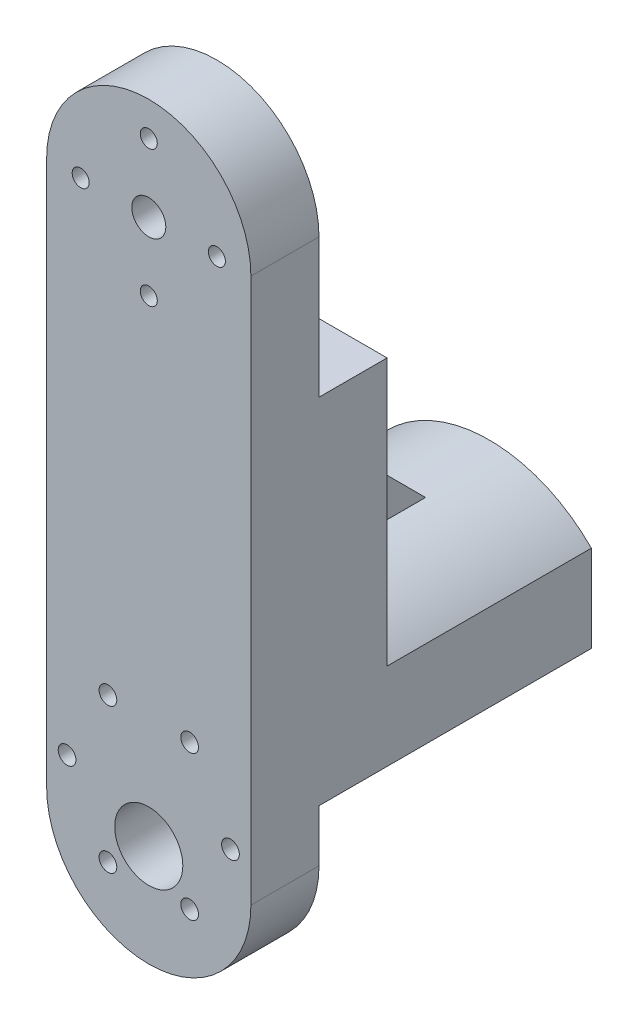
ISO-10303-21;
HEADER;
FILE_DESCRIPTION(('STEP AP214'),'2;1');
FILE_NAME('part.step','',(''),(''),'','','');
FILE_SCHEMA(('AUTOMOTIVE_DESIGN { 1 0 10303 214 1 1 1 1 }'));
ENDSEC;
DATA;
#1=APPLICATION_CONTEXT('core data for automotive mechanical design processes');
#2=APPLICATION_PROTOCOL_DEFINITION('international standard','automotive_design',2000,#1);
#3=PRODUCT_CONTEXT('',#1,'mechanical');
#4=PRODUCT('Part','Part','',(#3));
#5=PRODUCT_RELATED_PRODUCT_CATEGORY('part','',(#4));
#6=PRODUCT_DEFINITION_FORMATION('','',#4);
#7=PRODUCT_DEFINITION_CONTEXT('part definition',#1,'design');
#8=PRODUCT_DEFINITION('design','',#6,#7);
#9=PRODUCT_DEFINITION_SHAPE('','',#8);
#10=(LENGTH_UNIT() NAMED_UNIT(*) SI_UNIT(.MILLI.,.METRE.));
#11=(NAMED_UNIT(*) PLANE_ANGLE_UNIT() SI_UNIT($,.RADIAN.));
#12=(NAMED_UNIT(*) SI_UNIT($,.STERADIAN.) SOLID_ANGLE_UNIT());
#13=UNCERTAINTY_MEASURE_WITH_UNIT(LENGTH_MEASURE(1.E-05),#10,'distance_accuracy_value','');
#14=(GEOMETRIC_REPRESENTATION_CONTEXT(3) GLOBAL_UNCERTAINTY_ASSIGNED_CONTEXT((#13)) GLOBAL_UNIT_ASSIGNED_CONTEXT((#10,
#11,#12)) REPRESENTATION_CONTEXT('',''));
#15=CARTESIAN_POINT('',(0.,0.,0.));
#16=DIRECTION('',(0.,0.,1.));
#17=DIRECTION('',(1.,0.,0.));
#18=AXIS2_PLACEMENT_3D('',#15,#16,#17);
#19=CARTESIAN_POINT('',(-19.051,-24.892,12.7));
#20=DIRECTION('',(0.,0.,1.));
#21=DIRECTION('',(0.,-1.,0.));
#22=AXIS2_PLACEMENT_3D('',#19,#20,#21);
#23=PLANE('',#22);
#24=CARTESIAN_POINT('',(0.,-50.8,12.7));
#25=DIRECTION('',(0.,0.,1.));
#26=DIRECTION('',(0.,-1.,0.));
#27=AXIS2_PLACEMENT_3D('',#24,#25,#26);
#28=CIRCLE('',#27,6.35);
#29=CARTESIAN_POINT('',(0.,-57.15,12.7));
#30=VERTEX_POINT('',#29);
#31=EDGE_CURVE('E221',#30,#30,#28,.F.);
#32=ORIENTED_EDGE('',*,*,#31,.F.);
#33=EDGE_LOOP('',(#32));
#34=FACE_BOUND('',#33,.T.);
#35=CARTESIAN_POINT('',(7.62000000000001,-30.1972759275123,12.7));
#36=DIRECTION('',(0.,0.,1.));
#37=DIRECTION('',(0.,-1.,0.));
#38=AXIS2_PLACEMENT_3D('',#35,#36,#37);
#39=CIRCLE('',#38,1.651);
#40=CARTESIAN_POINT('',(7.62000000000001,-31.8482759275123,12.7));
#41=VERTEX_POINT('',#40);
#42=EDGE_CURVE('E273',#41,#41,#39,.F.);
#43=ORIENTED_EDGE('',*,*,#42,.F.);
#44=EDGE_LOOP('',(#43));
#45=FACE_BOUND('',#44,.T.);
#46=CARTESIAN_POINT('',(7.61999999999998,-57.1787240724877,12.7));
#47=DIRECTION('',(0.,0.,1.));
#48=DIRECTION('',(0.,-1.,0.));
#49=AXIS2_PLACEMENT_3D('',#46,#47,#48);
#50=CIRCLE('',#49,1.651);
#51=CARTESIAN_POINT('',(7.61999999999998,-58.8297240724877,12.7));
#52=VERTEX_POINT('',#51);
#53=EDGE_CURVE('E267',#52,#52,#50,.F.);
#54=ORIENTED_EDGE('',*,*,#53,.F.);
#55=EDGE_LOOP('',(#54));
#56=FACE_BOUND('',#55,.T.);
#57=CARTESIAN_POINT('',(-7.62000000000002,-57.1787240724877,12.7));
#58=DIRECTION('',(0.,0.,1.));
#59=DIRECTION('',(0.,-1.,0.));
#60=AXIS2_PLACEMENT_3D('',#57,#58,#59);
#61=CIRCLE('',#60,1.651);
#62=CARTESIAN_POINT('',(-7.62000000000002,-58.8297240724877,12.7));
#63=VERTEX_POINT('',#62);
#64=EDGE_CURVE('E259',#63,#63,#61,.F.);
#65=ORIENTED_EDGE('',*,*,#64,.F.);
#66=EDGE_LOOP('',(#65));
#67=FACE_BOUND('',#66,.T.);
#68=CARTESIAN_POINT('',(-15.24,-43.688,12.7));
#69=DIRECTION('',(0.,0.,1.));
#70=DIRECTION('',(0.,-1.,0.));
#71=AXIS2_PLACEMENT_3D('',#68,#69,#70);
#72=CIRCLE('',#71,1.651);
#73=CARTESIAN_POINT('',(-15.24,-45.339,12.7));
#74=VERTEX_POINT('',#73);
#75=EDGE_CURVE('E260',#74,#74,#72,.F.);
#76=ORIENTED_EDGE('',*,*,#75,.F.);
#77=EDGE_LOOP('',(#76));
#78=FACE_BOUND('',#77,.T.);
#79=CARTESIAN_POINT('',(-7.62000000000002,-30.1972759275123,12.7));
#80=DIRECTION('',(0.,0.,1.));
#81=DIRECTION('',(0.,-1.,0.));
#82=AXIS2_PLACEMENT_3D('',#79,#80,#81);
#83=CIRCLE('',#82,1.651);
#84=CARTESIAN_POINT('',(-7.62000000000002,-31.8482759275123,12.7));
#85=VERTEX_POINT('',#84);
#86=EDGE_CURVE('E284',#85,#85,#83,.F.);
#87=ORIENTED_EDGE('',*,*,#86,.F.);
#88=EDGE_LOOP('',(#87));
#89=FACE_BOUND('',#88,.T.);
#90=CARTESIAN_POINT('',(15.24,-43.688,12.7));
#91=DIRECTION('',(0.,0.,1.));
#92=DIRECTION('',(0.,-1.,0.));
#93=AXIS2_PLACEMENT_3D('',#90,#91,#92);
#94=CIRCLE('',#93,1.65099999999999);
#95=CARTESIAN_POINT('',(15.24,-45.339,12.7));
#96=VERTEX_POINT('',#95);
#97=EDGE_CURVE('E279',#96,#96,#94,.F.);
#98=ORIENTED_EDGE('',*,*,#97,.F.);
#99=EDGE_LOOP('',(#98));
#100=FACE_BOUND('',#99,.T.);
#101=DIRECTION('',(1.,0.,0.));
#102=VECTOR('',#101,1.);
#103=CARTESIAN_POINT('',(-19.05,-41.148,12.7));
#104=LINE('',#103,#102);
#105=CARTESIAN_POINT('',(-19.05,-41.148,12.7));
#106=VERTEX_POINT('',#105);
#107=CARTESIAN_POINT('',(-18.3248028638783,-41.148,12.7));
#108=VERTEX_POINT('',#107);
#109=EDGE_CURVE('E323',#106,#108,#104,.T.);
#110=ORIENTED_EDGE('',*,*,#109,.T.);
#111=CARTESIAN_POINT('',(0.,-43.688,12.7));
#112=DIRECTION('',(0.,0.,1.));
#113=DIRECTION('',(0.,-1.,0.));
#114=AXIS2_PLACEMENT_3D('',#111,#112,#113);
#115=CIRCLE('',#114,18.5);
#116=CARTESIAN_POINT('',(18.3248028638782,-41.148,12.7));
#117=VERTEX_POINT('',#116);
#118=EDGE_CURVE('E329',#108,#117,#115,.F.);
#119=ORIENTED_EDGE('',*,*,#118,.T.);
#120=DIRECTION('',(0.997629661882093,0.0688117557763239,0.));
#121=VECTOR('',#120,1.);
#122=CARTESIAN_POINT('',(18.3248028638783,-41.148,12.7));
#123=LINE('',#122,#121);
#124=CARTESIAN_POINT('',(19.05,-41.0979793459164,12.7));
#125=VERTEX_POINT('',#124);
#126=EDGE_CURVE('E332',#117,#125,#123,.T.);
#127=ORIENTED_EDGE('',*,*,#126,.T.);
#128=DIRECTION('',(0.,-1.,0.));
#129=VECTOR('',#128,1.);
#130=CARTESIAN_POINT('',(19.05,-24.892,12.7));
#131=LINE('',#130,#129);
#132=CARTESIAN_POINT('',(19.05,-50.8,12.7));
#133=VERTEX_POINT('',#132);
#134=EDGE_CURVE('E215',#125,#133,#131,.T.);
#135=ORIENTED_EDGE('',*,*,#134,.T.);
#136=CARTESIAN_POINT('',(0.,-50.8,12.7));
#137=DIRECTION('',(0.,0.,1.));
#138=DIRECTION('',(0.,-1.,0.));
#139=AXIS2_PLACEMENT_3D('',#136,#137,#138);
#140=CIRCLE('',#139,19.05);
#141=CARTESIAN_POINT('',(-19.05,-50.8,12.7));
#142=VERTEX_POINT('',#141);
#143=EDGE_CURVE('E224',#133,#142,#140,.F.);
#144=ORIENTED_EDGE('',*,*,#143,.T.);
#145=DIRECTION('',(0.,1.,0.));
#146=VECTOR('',#145,1.);
#147=CARTESIAN_POINT('',(-19.05,-24.892,12.7));
#148=LINE('',#147,#146);
#149=EDGE_CURVE('E218',#142,#106,#148,.T.);
#150=ORIENTED_EDGE('',*,*,#149,.T.);
#151=EDGE_LOOP('',(#110,#119,#127,#135,#144,#150));
#152=FACE_BOUND('',#151,.T.);
#153=ADVANCED_FACE('F34',(#34,#45,#56,#67,#78,#89,#100,#152),#23,.F.);
#154=CARTESIAN_POINT('',(0.,50.8,25.4));
#155=DIRECTION('',(0.,0.,-1.));
#156=DIRECTION('',(-1.,0.,0.));
#157=AXIS2_PLACEMENT_3D('',#154,#155,#156);
#158=PLANE('',#157);
#159=CARTESIAN_POINT('',(15.24,-43.688,25.4));
#160=DIRECTION('',(0.,0.,-1.));
#161=DIRECTION('',(-1.,0.,0.));
#162=AXIS2_PLACEMENT_3D('',#159,#160,#161);
#163=CIRCLE('',#162,1.65099999999999);
#164=CARTESIAN_POINT('',(13.589,-43.688,25.4));
#165=VERTEX_POINT('',#164);
#166=EDGE_CURVE('E226',#165,#165,#163,.F.);
#167=ORIENTED_EDGE('',*,*,#166,.F.);
#168=EDGE_LOOP('',(#167));
#169=FACE_BOUND('',#168,.T.);
#170=CARTESIAN_POINT('',(-7.62000000000002,-30.1972759275123,25.4));
#171=DIRECTION('',(0.,0.,-1.));
#172=DIRECTION('',(-1.,0.,0.));
#173=AXIS2_PLACEMENT_3D('',#170,#171,#172);
#174=CIRCLE('',#173,1.651);
#175=CARTESIAN_POINT('',(-9.27100000000002,-30.1972759275123,25.4));
#176=VERTEX_POINT('',#175);
#177=EDGE_CURVE('E263',#176,#176,#174,.F.);
#178=ORIENTED_EDGE('',*,*,#177,.F.);
#179=EDGE_LOOP('',(#178));
#180=FACE_BOUND('',#179,.T.);
#181=CARTESIAN_POINT('',(-15.24,-43.688,25.4));
#182=DIRECTION('',(0.,0.,-1.));
#183=DIRECTION('',(-1.,0.,0.));
#184=AXIS2_PLACEMENT_3D('',#181,#182,#183);
#185=CIRCLE('',#184,1.651);
#186=CARTESIAN_POINT('',(-16.891,-43.688,25.4));
#187=VERTEX_POINT('',#186);
#188=EDGE_CURVE('E256',#187,#187,#185,.F.);
#189=ORIENTED_EDGE('',*,*,#188,.F.);
#190=EDGE_LOOP('',(#189));
#191=FACE_BOUND('',#190,.T.);
#192=CARTESIAN_POINT('',(-7.62000000000002,-57.1787240724877,25.4));
#193=DIRECTION('',(0.,0.,-1.));
#194=DIRECTION('',(-1.,0.,0.));
#195=AXIS2_PLACEMENT_3D('',#192,#193,#194);
#196=CIRCLE('',#195,1.651);
#197=CARTESIAN_POINT('',(-9.27100000000001,-57.1787240724877,25.4));
#198=VERTEX_POINT('',#197);
#199=EDGE_CURVE('E264',#198,#198,#196,.F.);
#200=ORIENTED_EDGE('',*,*,#199,.F.);
#201=EDGE_LOOP('',(#200));
#202=FACE_BOUND('',#201,.T.);
#203=CARTESIAN_POINT('',(7.61999999999998,-57.1787240724877,25.4));
#204=DIRECTION('',(0.,0.,-1.));
#205=DIRECTION('',(-1.,0.,0.));
#206=AXIS2_PLACEMENT_3D('',#203,#204,#205);
#207=CIRCLE('',#206,1.651);
#208=CARTESIAN_POINT('',(5.96899999999999,-57.1787240724877,25.4));
#209=VERTEX_POINT('',#208);
#210=EDGE_CURVE('E270',#209,#209,#207,.F.);
#211=ORIENTED_EDGE('',*,*,#210,.F.);
#212=EDGE_LOOP('',(#211));
#213=FACE_BOUND('',#212,.T.);
#214=CARTESIAN_POINT('',(7.62000000000001,-30.1972759275123,25.4));
#215=DIRECTION('',(0.,0.,-1.));
#216=DIRECTION('',(-1.,0.,0.));
#217=AXIS2_PLACEMENT_3D('',#214,#215,#216);
#218=CIRCLE('',#217,1.651);
#219=CARTESIAN_POINT('',(5.96900000000001,-30.1972759275123,25.4));
#220=VERTEX_POINT('',#219);
#221=EDGE_CURVE('E276',#220,#220,#218,.F.);
#222=ORIENTED_EDGE('',*,*,#221,.F.);
#223=EDGE_LOOP('',(#222));
#224=FACE_BOUND('',#223,.T.);
#225=CARTESIAN_POINT('',(0.,50.8,25.4));
#226=DIRECTION('',(0.,0.,1.));
#227=DIRECTION('',(-1.,0.,0.));
#228=AXIS2_PLACEMENT_3D('',#225,#226,#227);
#229=CIRCLE('',#228,19.05);
#230=CARTESIAN_POINT('',(19.05,50.8,25.4));
#231=VERTEX_POINT('',#230);
#232=CARTESIAN_POINT('',(-19.05,50.8,25.4));
#233=VERTEX_POINT('',#232);
#234=EDGE_CURVE('E186',#231,#233,#229,.T.);
#235=ORIENTED_EDGE('',*,*,#234,.T.);
#236=DIRECTION('',(0.,-1.,0.));
#237=VECTOR('',#236,1.);
#238=CARTESIAN_POINT('',(-19.05,50.8,25.4));
#239=LINE('',#238,#237);
#240=CARTESIAN_POINT('',(-19.05,-50.8,25.4));
#241=VERTEX_POINT('',#240);
#242=EDGE_CURVE('E193',#233,#241,#239,.T.);
#243=ORIENTED_EDGE('',*,*,#242,.T.);
#244=CARTESIAN_POINT('',(0.,-50.8,25.4));
#245=DIRECTION('',(0.,0.,1.));
#246=DIRECTION('',(1.,0.,0.));
#247=AXIS2_PLACEMENT_3D('',#244,#245,#246);
#248=CIRCLE('',#247,19.05);
#249=CARTESIAN_POINT('',(19.05,-50.8,25.4));
#250=VERTEX_POINT('',#249);
#251=EDGE_CURVE('E191',#241,#250,#248,.T.);
#252=ORIENTED_EDGE('',*,*,#251,.T.);
#253=DIRECTION('',(0.,1.,0.));
#254=VECTOR('',#253,1.);
#255=CARTESIAN_POINT('',(19.05,50.8,25.4));
#256=LINE('',#255,#254);
#257=EDGE_CURVE('E182',#250,#231,#256,.T.);
#258=ORIENTED_EDGE('',*,*,#257,.T.);
#259=EDGE_LOOP('',(#235,#243,#252,#258));
#260=FACE_BOUND('',#259,.T.);
#261=CARTESIAN_POINT('',(0.,50.8,25.4));
#262=DIRECTION('',(0.,0.,1.));
#263=DIRECTION('',(1.,0.,0.));
#264=AXIS2_PLACEMENT_3D('',#261,#262,#263);
#265=CIRCLE('',#264,3.175);
#266=CARTESIAN_POINT('',(3.17499999999998,50.8,25.4));
#267=VERTEX_POINT('',#266);
#268=EDGE_CURVE('E189',#267,#267,#265,.T.);
#269=ORIENTED_EDGE('',*,*,#268,.F.);
#270=EDGE_LOOP('',(#269));
#271=FACE_BOUND('',#270,.T.);
#272=CARTESIAN_POINT('',(0.,-50.8,25.4));
#273=DIRECTION('',(0.,0.,1.));
#274=DIRECTION('',(1.,0.,0.));
#275=AXIS2_PLACEMENT_3D('',#272,#273,#274);
#276=CIRCLE('',#275,6.35);
#277=CARTESIAN_POINT('',(6.35000000000001,-50.8,25.4));
#278=VERTEX_POINT('',#277);
#279=EDGE_CURVE('E199',#278,#278,#276,.T.);
#280=ORIENTED_EDGE('',*,*,#279,.F.);
#281=EDGE_LOOP('',(#280));
#282=FACE_BOUND('',#281,.T.);
#283=CARTESIAN_POINT('',(0.,63.5,25.4));
#284=DIRECTION('',(0.,0.,1.));
#285=DIRECTION('',(1.,0.,0.));
#286=AXIS2_PLACEMENT_3D('',#283,#284,#285);
#287=CIRCLE('',#286,1.5875);
#288=CARTESIAN_POINT('',(1.5875,63.5,25.4));
#289=VERTEX_POINT('',#288);
#290=EDGE_CURVE('E202',#289,#289,#287,.T.);
#291=ORIENTED_EDGE('',*,*,#290,.F.);
#292=EDGE_LOOP('',(#291));
#293=FACE_BOUND('',#292,.T.);
#294=CARTESIAN_POINT('',(-12.7,50.8,25.4));
#295=DIRECTION('',(0.,0.,1.));
#296=DIRECTION('',(1.,0.,0.));
#297=AXIS2_PLACEMENT_3D('',#294,#295,#296);
#298=CIRCLE('',#297,1.5875);
#299=CARTESIAN_POINT('',(-11.1125,50.8,25.4));
#300=VERTEX_POINT('',#299);
#301=EDGE_CURVE('E205',#300,#300,#298,.T.);
#302=ORIENTED_EDGE('',*,*,#301,.F.);
#303=EDGE_LOOP('',(#302));
#304=FACE_BOUND('',#303,.T.);
#305=CARTESIAN_POINT('',(0.,38.1,25.4));
#306=DIRECTION('',(0.,0.,1.));
#307=DIRECTION('',(1.,0.,0.));
#308=AXIS2_PLACEMENT_3D('',#305,#306,#307);
#309=CIRCLE('',#308,1.5875);
#310=CARTESIAN_POINT('',(1.5875,38.1,25.4));
#311=VERTEX_POINT('',#310);
#312=EDGE_CURVE('E208',#311,#311,#309,.T.);
#313=ORIENTED_EDGE('',*,*,#312,.F.);
#314=EDGE_LOOP('',(#313));
#315=FACE_BOUND('',#314,.T.);
#316=CARTESIAN_POINT('',(12.7,50.8,25.4));
#317=DIRECTION('',(0.,0.,1.));
#318=DIRECTION('',(1.,0.,0.));
#319=AXIS2_PLACEMENT_3D('',#316,#317,#318);
#320=CIRCLE('',#319,1.5875);
#321=CARTESIAN_POINT('',(14.2875,50.8,25.4));
#322=VERTEX_POINT('',#321);
#323=EDGE_CURVE('E211',#322,#322,#320,.T.);
#324=ORIENTED_EDGE('',*,*,#323,.F.);
#325=EDGE_LOOP('',(#324));
#326=FACE_BOUND('',#325,.T.);
#327=ADVANCED_FACE('F374',(#169,#180,#191,#202,#213,#224,#260,#271,#282,#293,#304,#315,#326),
#158,.F.);
#328=CARTESIAN_POINT('',(0.,50.8,0.));
#329=DIRECTION('',(0.,0.,-1.));
#330=DIRECTION('',(-1.,0.,0.));
#331=AXIS2_PLACEMENT_3D('',#328,#329,#330);
#332=PLANE('',#331);
#333=DIRECTION('',(0.,-1.,0.));
#334=VECTOR('',#333,1.);
#335=CARTESIAN_POINT('',(3.175,-19.4662340642476,0.));
#336=LINE('',#335,#334);
#337=CARTESIAN_POINT('',(3.175,5.93376593575245,0.));
#338=VERTEX_POINT('',#337);
#339=CARTESIAN_POINT('',(3.175,-17.1152415620809,0.));
#340=VERTEX_POINT('',#339);
#341=EDGE_CURVE('E49',#338,#340,#336,.T.);
#342=ORIENTED_EDGE('',*,*,#341,.F.);
#343=DIRECTION('',(-1.,0.,0.));
#344=VECTOR('',#343,1.);
#345=CARTESIAN_POINT('',(3.175,5.93376593575244,0.));
#346=LINE('',#345,#344);
#347=CARTESIAN_POINT('',(-3.175,5.93376593575244,0.));
#348=VERTEX_POINT('',#347);
#349=EDGE_CURVE('E54',#338,#348,#346,.T.);
#350=ORIENTED_EDGE('',*,*,#349,.T.);
#351=DIRECTION('',(0.,-1.,0.));
#352=VECTOR('',#351,1.);
#353=CARTESIAN_POINT('',(-3.175,-19.4662340642476,0.));
#354=LINE('',#353,#352);
#355=CARTESIAN_POINT('',(-3.175,-17.1152415620809,0.));
#356=VERTEX_POINT('',#355);
#357=EDGE_CURVE('E160',#348,#356,#354,.T.);
#358=ORIENTED_EDGE('',*,*,#357,.T.);
#359=CARTESIAN_POINT('',(0.,-43.688,0.));
#360=DIRECTION('',(0.,0.,-1.));
#361=DIRECTION('',(1.,0.,0.));
#362=AXIS2_PLACEMENT_3D('',#359,#360,#361);
#363=CIRCLE('',#362,26.7617659357524);
#364=CARTESIAN_POINT('',(-19.05,-24.892,0.));
#365=VERTEX_POINT('',#364);
#366=EDGE_CURVE('E146',#365,#356,#363,.T.);
#367=ORIENTED_EDGE('',*,*,#366,.F.);
#368=DIRECTION('',(0.,-1.,0.));
#369=VECTOR('',#368,1.);
#370=CARTESIAN_POINT('',(-19.05,50.8,0.));
#371=LINE('',#370,#369);
#372=CARTESIAN_POINT('',(-19.05,24.892,0.));
#373=VERTEX_POINT('',#372);
#374=EDGE_CURVE('E187',#373,#365,#371,.T.);
#375=ORIENTED_EDGE('',*,*,#374,.F.);
#376=DIRECTION('',(1.,0.,0.));
#377=VECTOR('',#376,1.);
#378=CARTESIAN_POINT('',(-19.051,24.892,0.));
#379=LINE('',#378,#377);
#380=CARTESIAN_POINT('',(19.05,24.892,0.));
#381=VERTEX_POINT('',#380);
#382=EDGE_CURVE('E228',#373,#381,#379,.T.);
#383=ORIENTED_EDGE('',*,*,#382,.T.);
#384=DIRECTION('',(0.,1.,0.));
#385=VECTOR('',#384,1.);
#386=CARTESIAN_POINT('',(19.05,50.8,0.));
#387=LINE('',#386,#385);
#388=CARTESIAN_POINT('',(19.05,-24.892,0.));
#389=VERTEX_POINT('',#388);
#390=EDGE_CURVE('E183',#389,#381,#387,.T.);
#391=ORIENTED_EDGE('',*,*,#390,.F.);
#392=EDGE_CURVE('E157',#340,#389,#363,.T.);
#393=ORIENTED_EDGE('',*,*,#392,.F.);
#394=EDGE_LOOP('',(#342,#350,#358,#367,#375,#383,#391,#393));
#395=FACE_BOUND('',#394,.T.);
#396=ADVANCED_FACE('F161',(#395),#332,.T.);
#397=CARTESIAN_POINT('',(0.,50.8,25.4));
#398=DIRECTION('',(0.,0.,-1.));
#399=DIRECTION('',(-1.,0.,0.));
#400=AXIS2_PLACEMENT_3D('',#397,#398,#399);
#401=CYLINDRICAL_SURFACE('',#400,19.05);
#402=DIRECTION('',(0.,0.,-1.));
#403=VECTOR('',#402,1.);
#404=CARTESIAN_POINT('',(19.05,50.8,25.4));
#405=LINE('',#404,#403);
#406=CARTESIAN_POINT('',(19.05,50.8,12.7));
#407=VERTEX_POINT('',#406);
#408=EDGE_CURVE('E179',#231,#407,#405,.T.);
#409=ORIENTED_EDGE('',*,*,#408,.T.);
#410=CARTESIAN_POINT('',(0.,50.8,12.7));
#411=DIRECTION('',(0.,0.,1.));
#412=DIRECTION('',(0.,-1.,0.));
#413=AXIS2_PLACEMENT_3D('',#410,#411,#412);
#414=CIRCLE('',#413,19.05);
#415=CARTESIAN_POINT('',(-19.05,50.8,12.7));
#416=VERTEX_POINT('',#415);
#417=EDGE_CURVE('E217',#416,#407,#414,.F.);
#418=ORIENTED_EDGE('',*,*,#417,.F.);
#419=DIRECTION('',(0.,0.,-1.));
#420=VECTOR('',#419,1.);
#421=CARTESIAN_POINT('',(-19.05,50.8,25.4));
#422=LINE('',#421,#420);
#423=EDGE_CURVE('E168',#233,#416,#422,.T.);
#424=ORIENTED_EDGE('',*,*,#423,.F.);
#425=ORIENTED_EDGE('',*,*,#234,.F.);
#426=EDGE_LOOP('',(#409,#418,#424,#425));
#427=FACE_BOUND('',#426,.T.);
#428=ADVANCED_FACE('F36',(#427),#401,.T.);
#429=CARTESIAN_POINT('',(-19.05,50.8,25.4));
#430=DIRECTION('',(1.,0.,0.));
#431=DIRECTION('',(0.,0.,-1.));
#432=AXIS2_PLACEMENT_3D('',#429,#430,#431);
#433=PLANE('',#432);
#434=DIRECTION('',(0.,0.,1.));
#435=VECTOR('',#434,1.);
#436=CARTESIAN_POINT('',(-19.05,-41.148,-38.1));
#437=LINE('',#436,#435);
#438=CARTESIAN_POINT('',(-19.05,-41.148,-38.1));
#439=VERTEX_POINT('',#438);
#440=EDGE_CURVE('E293',#439,#106,#437,.T.);
#441=ORIENTED_EDGE('',*,*,#440,.T.);
#442=ORIENTED_EDGE('',*,*,#149,.F.);
#443=DIRECTION('',(0.,0.,-1.));
#444=VECTOR('',#443,1.);
#445=CARTESIAN_POINT('',(-19.05,-50.8,25.4));
#446=LINE('',#445,#444);
#447=EDGE_CURVE('E171',#241,#142,#446,.T.);
#448=ORIENTED_EDGE('',*,*,#447,.F.);
#449=ORIENTED_EDGE('',*,*,#242,.F.);
#450=ORIENTED_EDGE('',*,*,#423,.T.);
#451=DIRECTION('',(0.,1.,0.));
#452=VECTOR('',#451,1.);
#453=CARTESIAN_POINT('',(-19.05,69.85,12.7));
#454=LINE('',#453,#452);
#455=CARTESIAN_POINT('',(-19.05,24.892,12.7));
#456=VERTEX_POINT('',#455);
#457=EDGE_CURVE('E214',#456,#416,#454,.T.);
#458=ORIENTED_EDGE('',*,*,#457,.F.);
#459=DIRECTION('',(0.,0.,1.));
#460=VECTOR('',#459,1.);
#461=CARTESIAN_POINT('',(-19.05,24.892,0.));
#462=LINE('',#461,#460);
#463=EDGE_CURVE('E232',#373,#456,#462,.T.);
#464=ORIENTED_EDGE('',*,*,#463,.F.);
#465=ORIENTED_EDGE('',*,*,#374,.T.);
#466=DIRECTION('',(0.,0.,1.));
#467=VECTOR('',#466,1.);
#468=CARTESIAN_POINT('',(-19.05,-24.892,-38.1));
#469=LINE('',#468,#467);
#470=CARTESIAN_POINT('',(-19.05,-24.892,-38.1));
#471=VERTEX_POINT('',#470);
#472=EDGE_CURVE('E153',#471,#365,#469,.T.);
#473=ORIENTED_EDGE('',*,*,#472,.F.);
#474=DIRECTION('',(0.,1.,0.));
#475=VECTOR('',#474,1.);
#476=CARTESIAN_POINT('',(-19.05,-24.892,-38.1));
#477=LINE('',#476,#475);
#478=EDGE_CURVE('E314',#439,#471,#477,.T.);
#479=ORIENTED_EDGE('',*,*,#478,.F.);
#480=EDGE_LOOP('',(#441,#442,#448,#449,#450,#458,#464,#465,#473,#479));
#481=FACE_BOUND('',#480,.T.);
#482=ADVANCED_FACE('F358',(#481),#433,.F.);
#483=CARTESIAN_POINT('',(0.,-50.8,25.4));
#484=DIRECTION('',(0.,0.,-1.));
#485=DIRECTION('',(-1.,0.,0.));
#486=AXIS2_PLACEMENT_3D('',#483,#484,#485);
#487=CYLINDRICAL_SURFACE('',#486,19.05);
#488=ORIENTED_EDGE('',*,*,#447,.T.);
#489=ORIENTED_EDGE('',*,*,#143,.F.);
#490=DIRECTION('',(0.,0.,-1.));
#491=VECTOR('',#490,1.);
#492=CARTESIAN_POINT('',(19.05,-50.8,25.4));
#493=LINE('',#492,#491);
#494=EDGE_CURVE('E176',#250,#133,#493,.T.);
#495=ORIENTED_EDGE('',*,*,#494,.F.);
#496=ORIENTED_EDGE('',*,*,#251,.F.);
#497=EDGE_LOOP('',(#488,#489,#495,#496));
#498=FACE_BOUND('',#497,.T.);
#499=ADVANCED_FACE('F381',(#498),#487,.T.);
#500=CARTESIAN_POINT('',(19.05,50.8,25.4));
#501=DIRECTION('',(-1.,0.,0.));
#502=DIRECTION('',(0.,0.,1.));
#503=AXIS2_PLACEMENT_3D('',#500,#501,#502);
#504=PLANE('',#503);
#505=ORIENTED_EDGE('',*,*,#134,.F.);
#506=DIRECTION('',(0.,0.,-1.));
#507=VECTOR('',#506,1.);
#508=CARTESIAN_POINT('',(19.05,-41.0979793459164,54.123031468013));
#509=LINE('',#508,#507);
#510=CARTESIAN_POINT('',(19.05,-41.0979793459164,0.));
#511=VERTEX_POINT('',#510);
#512=EDGE_CURVE('E320',#125,#511,#509,.T.);
#513=ORIENTED_EDGE('',*,*,#512,.T.);
#514=DIRECTION('',(0.,0.,1.));
#515=VECTOR('',#514,1.);
#516=CARTESIAN_POINT('',(19.05,-41.0979793459164,-38.1));
#517=LINE('',#516,#515);
#518=CARTESIAN_POINT('',(19.05,-41.0979793459164,-38.1));
#519=VERTEX_POINT('',#518);
#520=EDGE_CURVE('E299',#519,#511,#517,.T.);
#521=ORIENTED_EDGE('',*,*,#520,.F.);
#522=DIRECTION('',(0.,-1.,0.));
#523=VECTOR('',#522,1.);
#524=CARTESIAN_POINT('',(19.05,-41.0979793459164,-38.1));
#525=LINE('',#524,#523);
#526=CARTESIAN_POINT('',(19.05,-24.892,-38.1));
#527=VERTEX_POINT('',#526);
#528=EDGE_CURVE('E310',#527,#519,#525,.T.);
#529=ORIENTED_EDGE('',*,*,#528,.F.);
#530=DIRECTION('',(0.,0.,1.));
#531=VECTOR('',#530,1.);
#532=CARTESIAN_POINT('',(19.05,-24.892,-38.1));
#533=LINE('',#532,#531);
#534=EDGE_CURVE('E296',#527,#389,#533,.T.);
#535=ORIENTED_EDGE('',*,*,#534,.T.);
#536=ORIENTED_EDGE('',*,*,#390,.T.);
#537=DIRECTION('',(0.,0.,-1.));
#538=VECTOR('',#537,1.);
#539=CARTESIAN_POINT('',(19.05,24.892,0.));
#540=LINE('',#539,#538);
#541=CARTESIAN_POINT('',(19.05,24.892,12.7));
#542=VERTEX_POINT('',#541);
#543=EDGE_CURVE('E247',#542,#381,#540,.T.);
#544=ORIENTED_EDGE('',*,*,#543,.F.);
#545=DIRECTION('',(0.,-1.,0.));
#546=VECTOR('',#545,1.);
#547=CARTESIAN_POINT('',(19.05,69.85,12.7));
#548=LINE('',#547,#546);
#549=EDGE_CURVE('E251',#407,#542,#548,.T.);
#550=ORIENTED_EDGE('',*,*,#549,.F.);
#551=ORIENTED_EDGE('',*,*,#408,.F.);
#552=ORIENTED_EDGE('',*,*,#257,.F.);
#553=ORIENTED_EDGE('',*,*,#494,.T.);
#554=EDGE_LOOP('',(#505,#513,#521,#529,#535,#536,#544,#550,#551,#552,#553));
#555=FACE_BOUND('',#554,.T.);
#556=ADVANCED_FACE('F351',(#555),#504,.F.);
#557=CARTESIAN_POINT('',(0.,50.8,25.4));
#558=DIRECTION('',(0.,0.,-1.));
#559=DIRECTION('',(-1.,0.,0.));
#560=AXIS2_PLACEMENT_3D('',#557,#558,#559);
#561=CYLINDRICAL_SURFACE('',#560,3.175);
#562=CARTESIAN_POINT('',(0.,50.8,12.7));
#563=DIRECTION('',(0.,0.,1.));
#564=DIRECTION('',(0.,-1.,0.));
#565=AXIS2_PLACEMENT_3D('',#562,#563,#564);
#566=CIRCLE('',#565,3.175);
#567=CARTESIAN_POINT('',(0.,47.625,12.7));
#568=VERTEX_POINT('',#567);
#569=EDGE_CURVE('E229',#568,#568,#566,.F.);
#570=ORIENTED_EDGE('',*,*,#569,.T.);
#571=EDGE_LOOP('',(#570));
#572=FACE_BOUND('',#571,.T.);
#573=ORIENTED_EDGE('',*,*,#268,.T.);
#574=EDGE_LOOP('',(#573));
#575=FACE_BOUND('',#574,.T.);
#576=ADVANCED_FACE('F443',(#572,#575),#561,.F.);
#577=CARTESIAN_POINT('',(0.,-50.8,25.4));
#578=DIRECTION('',(0.,0.,-1.));
#579=DIRECTION('',(-1.,0.,0.));
#580=AXIS2_PLACEMENT_3D('',#577,#578,#579);
#581=CYLINDRICAL_SURFACE('',#580,6.35);
#582=ORIENTED_EDGE('',*,*,#31,.T.);
#583=EDGE_LOOP('',(#582));
#584=FACE_BOUND('',#583,.T.);
#585=ORIENTED_EDGE('',*,*,#279,.T.);
#586=EDGE_LOOP('',(#585));
#587=FACE_BOUND('',#586,.T.);
#588=ADVANCED_FACE('F439',(#584,#587),#581,.F.);
#589=CARTESIAN_POINT('',(0.,63.5,25.4));
#590=DIRECTION('',(0.,0.,-1.));
#591=DIRECTION('',(-1.,0.,0.));
#592=AXIS2_PLACEMENT_3D('',#589,#590,#591);
#593=CYLINDRICAL_SURFACE('',#592,1.5875);
#594=CARTESIAN_POINT('',(0.,63.5,12.7));
#595=DIRECTION('',(0.,0.,1.));
#596=DIRECTION('',(0.,-1.,0.));
#597=AXIS2_PLACEMENT_3D('',#594,#595,#596);
#598=CIRCLE('',#597,1.5875);
#599=CARTESIAN_POINT('',(0.,61.9125,12.7));
#600=VERTEX_POINT('',#599);
#601=EDGE_CURVE('E233',#600,#600,#598,.F.);
#602=ORIENTED_EDGE('',*,*,#601,.T.);
#603=EDGE_LOOP('',(#602));
#604=FACE_BOUND('',#603,.T.);
#605=ORIENTED_EDGE('',*,*,#290,.T.);
#606=EDGE_LOOP('',(#605));
#607=FACE_BOUND('',#606,.T.);
#608=ADVANCED_FACE('F435',(#604,#607),#593,.F.);
#609=CARTESIAN_POINT('',(-12.7,50.8,25.4));
#610=DIRECTION('',(0.,0.,-1.));
#611=DIRECTION('',(-1.,0.,0.));
#612=AXIS2_PLACEMENT_3D('',#609,#610,#611);
#613=CYLINDRICAL_SURFACE('',#612,1.5875);
#614=CARTESIAN_POINT('',(-12.7,50.8,12.7));
#615=DIRECTION('',(0.,0.,1.));
#616=DIRECTION('',(0.,-1.,0.));
#617=AXIS2_PLACEMENT_3D('',#614,#615,#616);
#618=CIRCLE('',#617,1.5875);
#619=CARTESIAN_POINT('',(-12.7,49.2125,12.7));
#620=VERTEX_POINT('',#619);
#621=EDGE_CURVE('E236',#620,#620,#618,.F.);
#622=ORIENTED_EDGE('',*,*,#621,.T.);
#623=EDGE_LOOP('',(#622));
#624=FACE_BOUND('',#623,.T.);
#625=ORIENTED_EDGE('',*,*,#301,.T.);
#626=EDGE_LOOP('',(#625));
#627=FACE_BOUND('',#626,.T.);
#628=ADVANCED_FACE('F431',(#624,#627),#613,.F.);
#629=CARTESIAN_POINT('',(0.,38.1,25.4));
#630=DIRECTION('',(0.,0.,-1.));
#631=DIRECTION('',(-1.,0.,0.));
#632=AXIS2_PLACEMENT_3D('',#629,#630,#631);
#633=CYLINDRICAL_SURFACE('',#632,1.5875);
#634=CARTESIAN_POINT('',(0.,38.1,12.7));
#635=DIRECTION('',(0.,0.,1.));
#636=DIRECTION('',(0.,-1.,0.));
#637=AXIS2_PLACEMENT_3D('',#634,#635,#636);
#638=CIRCLE('',#637,1.5875);
#639=CARTESIAN_POINT('',(0.,36.5125,12.7));
#640=VERTEX_POINT('',#639);
#641=EDGE_CURVE('E239',#640,#640,#638,.F.);
#642=ORIENTED_EDGE('',*,*,#641,.T.);
#643=EDGE_LOOP('',(#642));
#644=FACE_BOUND('',#643,.T.);
#645=ORIENTED_EDGE('',*,*,#312,.T.);
#646=EDGE_LOOP('',(#645));
#647=FACE_BOUND('',#646,.T.);
#648=ADVANCED_FACE('F427',(#644,#647),#633,.F.);
#649=CARTESIAN_POINT('',(12.7,50.8,25.4));
#650=DIRECTION('',(0.,0.,-1.));
#651=DIRECTION('',(-1.,0.,0.));
#652=AXIS2_PLACEMENT_3D('',#649,#650,#651);
#653=CYLINDRICAL_SURFACE('',#652,1.5875);
#654=CARTESIAN_POINT('',(12.7,50.8,12.7));
#655=DIRECTION('',(0.,0.,1.));
#656=DIRECTION('',(0.,-1.,0.));
#657=AXIS2_PLACEMENT_3D('',#654,#655,#656);
#658=CIRCLE('',#657,1.5875);
#659=CARTESIAN_POINT('',(12.7,49.2125,12.7));
#660=VERTEX_POINT('',#659);
#661=EDGE_CURVE('E242',#660,#660,#658,.F.);
#662=ORIENTED_EDGE('',*,*,#661,.T.);
#663=EDGE_LOOP('',(#662));
#664=FACE_BOUND('',#663,.T.);
#665=ORIENTED_EDGE('',*,*,#323,.T.);
#666=EDGE_LOOP('',(#665));
#667=FACE_BOUND('',#666,.T.);
#668=ADVANCED_FACE('F424',(#664,#667),#653,.F.);
#669=CARTESIAN_POINT('',(-19.051,24.892,0.));
#670=DIRECTION('',(0.,-1.,0.));
#671=DIRECTION('',(0.,0.,-1.));
#672=AXIS2_PLACEMENT_3D('',#669,#670,#671);
#673=PLANE('',#672);
#674=ORIENTED_EDGE('',*,*,#463,.T.);
#675=DIRECTION('',(1.,0.,0.));
#676=VECTOR('',#675,1.);
#677=CARTESIAN_POINT('',(-19.051,24.892,12.7));
#678=LINE('',#677,#676);
#679=EDGE_CURVE('E245',#456,#542,#678,.T.);
#680=ORIENTED_EDGE('',*,*,#679,.T.);
#681=ORIENTED_EDGE('',*,*,#543,.T.);
#682=ORIENTED_EDGE('',*,*,#382,.F.);
#683=EDGE_LOOP('',(#674,#680,#681,#682));
#684=FACE_BOUND('',#683,.T.);
#685=ADVANCED_FACE('F363',(#684),#673,.F.);
#686=CARTESIAN_POINT('',(-19.051,69.85,12.7));
#687=DIRECTION('',(0.,0.,1.));
#688=DIRECTION('',(0.,-1.,0.));
#689=AXIS2_PLACEMENT_3D('',#686,#687,#688);
#690=PLANE('',#689);
#691=ORIENTED_EDGE('',*,*,#569,.F.);
#692=EDGE_LOOP('',(#691));
#693=FACE_BOUND('',#692,.T.);
#694=ORIENTED_EDGE('',*,*,#601,.F.);
#695=EDGE_LOOP('',(#694));
#696=FACE_BOUND('',#695,.T.);
#697=ORIENTED_EDGE('',*,*,#621,.F.);
#698=EDGE_LOOP('',(#697));
#699=FACE_BOUND('',#698,.T.);
#700=ORIENTED_EDGE('',*,*,#641,.F.);
#701=EDGE_LOOP('',(#700));
#702=FACE_BOUND('',#701,.T.);
#703=ORIENTED_EDGE('',*,*,#661,.F.);
#704=EDGE_LOOP('',(#703));
#705=FACE_BOUND('',#704,.T.);
#706=ORIENTED_EDGE('',*,*,#417,.T.);
#707=ORIENTED_EDGE('',*,*,#549,.T.);
#708=ORIENTED_EDGE('',*,*,#679,.F.);
#709=ORIENTED_EDGE('',*,*,#457,.T.);
#710=EDGE_LOOP('',(#706,#707,#708,#709));
#711=FACE_BOUND('',#710,.T.);
#712=ADVANCED_FACE('F365',(#693,#696,#699,#702,#705,#711),#690,.F.);
#713=CARTESIAN_POINT('',(7.62000000000001,-30.1972759275123,25.401));
#714=DIRECTION('',(0.,0.,-1.));
#715=DIRECTION('',(-1.,0.,0.));
#716=AXIS2_PLACEMENT_3D('',#713,#714,#715);
#717=CYLINDRICAL_SURFACE('',#716,1.651);
#718=ORIENTED_EDGE('',*,*,#42,.T.);
#719=EDGE_LOOP('',(#718));
#720=FACE_BOUND('',#719,.T.);
#721=ORIENTED_EDGE('',*,*,#221,.T.);
#722=EDGE_LOOP('',(#721));
#723=FACE_BOUND('',#722,.T.);
#724=ADVANCED_FACE('F480',(#720,#723),#717,.F.);
#725=CARTESIAN_POINT('',(7.61999999999998,-57.1787240724877,25.401));
#726=DIRECTION('',(0.,0.,-1.));
#727=DIRECTION('',(-1.,0.,0.));
#728=AXIS2_PLACEMENT_3D('',#725,#726,#727);
#729=CYLINDRICAL_SURFACE('',#728,1.651);
#730=ORIENTED_EDGE('',*,*,#53,.T.);
#731=EDGE_LOOP('',(#730));
#732=FACE_BOUND('',#731,.T.);
#733=ORIENTED_EDGE('',*,*,#210,.T.);
#734=EDGE_LOOP('',(#733));
#735=FACE_BOUND('',#734,.T.);
#736=ADVANCED_FACE('F485',(#732,#735),#729,.F.);
#737=CARTESIAN_POINT('',(-7.62000000000002,-57.1787240724877,25.401));
#738=DIRECTION('',(0.,0.,-1.));
#739=DIRECTION('',(-1.,0.,0.));
#740=AXIS2_PLACEMENT_3D('',#737,#738,#739);
#741=CYLINDRICAL_SURFACE('',#740,1.651);
#742=ORIENTED_EDGE('',*,*,#64,.T.);
#743=EDGE_LOOP('',(#742));
#744=FACE_BOUND('',#743,.T.);
#745=ORIENTED_EDGE('',*,*,#199,.T.);
#746=EDGE_LOOP('',(#745));
#747=FACE_BOUND('',#746,.T.);
#748=ADVANCED_FACE('F495',(#744,#747),#741,.F.);
#749=CARTESIAN_POINT('',(-15.24,-43.688,25.401));
#750=DIRECTION('',(0.,0.,-1.));
#751=DIRECTION('',(-1.,0.,0.));
#752=AXIS2_PLACEMENT_3D('',#749,#750,#751);
#753=CYLINDRICAL_SURFACE('',#752,1.651);
#754=ORIENTED_EDGE('',*,*,#75,.T.);
#755=EDGE_LOOP('',(#754));
#756=FACE_BOUND('',#755,.T.);
#757=ORIENTED_EDGE('',*,*,#188,.T.);
#758=EDGE_LOOP('',(#757));
#759=FACE_BOUND('',#758,.T.);
#760=ADVANCED_FACE('F505',(#756,#759),#753,.F.);
#761=CARTESIAN_POINT('',(-7.62000000000002,-30.1972759275123,25.401));
#762=DIRECTION('',(0.,0.,-1.));
#763=DIRECTION('',(-1.,0.,0.));
#764=AXIS2_PLACEMENT_3D('',#761,#762,#763);
#765=CYLINDRICAL_SURFACE('',#764,1.651);
#766=ORIENTED_EDGE('',*,*,#86,.T.);
#767=EDGE_LOOP('',(#766));
#768=FACE_BOUND('',#767,.T.);
#769=ORIENTED_EDGE('',*,*,#177,.T.);
#770=EDGE_LOOP('',(#769));
#771=FACE_BOUND('',#770,.T.);
#772=ADVANCED_FACE('F515',(#768,#771),#765,.F.);
#773=CARTESIAN_POINT('',(15.24,-43.688,25.401));
#774=DIRECTION('',(0.,0.,-1.));
#775=DIRECTION('',(-1.,0.,0.));
#776=AXIS2_PLACEMENT_3D('',#773,#774,#775);
#777=CYLINDRICAL_SURFACE('',#776,1.65099999999999);
#778=ORIENTED_EDGE('',*,*,#97,.T.);
#779=EDGE_LOOP('',(#778));
#780=FACE_BOUND('',#779,.T.);
#781=ORIENTED_EDGE('',*,*,#166,.T.);
#782=EDGE_LOOP('',(#781));
#783=FACE_BOUND('',#782,.T.);
#784=ADVANCED_FACE('F525',(#780,#783),#777,.F.);
#785=CARTESIAN_POINT('',(0.,-43.688,-38.1));
#786=DIRECTION('',(0.,0.,1.));
#787=DIRECTION('',(1.,0.,0.));
#788=AXIS2_PLACEMENT_3D('',#785,#786,#787);
#789=CYLINDRICAL_SURFACE('',#788,18.5);
#790=DIRECTION('',(0.,0.,1.));
#791=VECTOR('',#790,1.);
#792=CARTESIAN_POINT('',(18.3248028638783,-41.148,-38.1));
#793=LINE('',#792,#791);
#794=CARTESIAN_POINT('',(18.3248028638783,-41.148,-38.1));
#795=VERTEX_POINT('',#794);
#796=CARTESIAN_POINT('',(18.3248028638782,-41.148,0.));
#797=VERTEX_POINT('',#796);
#798=EDGE_CURVE('E302',#795,#797,#793,.T.);
#799=ORIENTED_EDGE('',*,*,#798,.T.);
#800=DIRECTION('',(0.,0.,-1.));
#801=VECTOR('',#800,1.);
#802=CARTESIAN_POINT('',(18.3248028638782,-41.148,54.123031468013));
#803=LINE('',#802,#801);
#804=EDGE_CURVE('E325',#117,#797,#803,.T.);
#805=ORIENTED_EDGE('',*,*,#804,.F.);
#806=ORIENTED_EDGE('',*,*,#118,.F.);
#807=DIRECTION('',(0.,0.,1.));
#808=VECTOR('',#807,1.);
#809=CARTESIAN_POINT('',(-18.3248028638783,-41.148,-38.1));
#810=LINE('',#809,#808);
#811=CARTESIAN_POINT('',(-18.3248028638783,-41.148,-38.1));
#812=VERTEX_POINT('',#811);
#813=EDGE_CURVE('E287',#812,#108,#810,.T.);
#814=ORIENTED_EDGE('',*,*,#813,.F.);
#815=CARTESIAN_POINT('',(0.,-43.688,-38.1));
#816=DIRECTION('',(0.,0.,1.));
#817=DIRECTION('',(-1.,0.,0.));
#818=AXIS2_PLACEMENT_3D('',#815,#816,#817);
#819=CIRCLE('',#818,18.5);
#820=EDGE_CURVE('E307',#795,#812,#819,.T.);
#821=ORIENTED_EDGE('',*,*,#820,.F.);
#822=EDGE_LOOP('',(#799,#805,#806,#814,#821));
#823=FACE_BOUND('',#822,.T.);
#824=ADVANCED_FACE('F391',(#823),#789,.F.);
#825=CARTESIAN_POINT('',(-19.05,-41.148,-38.1));
#826=DIRECTION('',(0.,1.,0.));
#827=DIRECTION('',(0.,0.,1.));
#828=AXIS2_PLACEMENT_3D('',#825,#826,#827);
#829=PLANE('',#828);
#830=ORIENTED_EDGE('',*,*,#813,.T.);
#831=ORIENTED_EDGE('',*,*,#109,.F.);
#832=ORIENTED_EDGE('',*,*,#440,.F.);
#833=DIRECTION('',(-1.,0.,0.));
#834=VECTOR('',#833,1.);
#835=CARTESIAN_POINT('',(-19.05,-41.148,-38.1));
#836=LINE('',#835,#834);
#837=EDGE_CURVE('E316',#812,#439,#836,.T.);
#838=ORIENTED_EDGE('',*,*,#837,.F.);
#839=EDGE_LOOP('',(#830,#831,#832,#838));
#840=FACE_BOUND('',#839,.T.);
#841=ADVANCED_FACE('F386',(#840),#829,.F.);
#842=CARTESIAN_POINT('',(0.,-43.688,-38.1));
#843=DIRECTION('',(0.,0.,1.));
#844=DIRECTION('',(1.,0.,0.));
#845=AXIS2_PLACEMENT_3D('',#842,#843,#844);
#846=CYLINDRICAL_SURFACE('',#845,26.7617659357524);
#847=CARTESIAN_POINT('',(0.,-43.688,-49.6217659357524));
#848=DIRECTION('',(0.,-0.707106781186548,0.707106781186548));
#849=DIRECTION('',(0.,0.707106781186548,0.707106781186548));
#850=AXIS2_PLACEMENT_3D('',#847,#848,#849);
#851=ELLIPSE('',#850,37.8468523393954,26.7617659357524);
#852=CARTESIAN_POINT('',(3.175,-17.1152415620809,-23.0490074978333));
#853=VERTEX_POINT('',#852);
#854=CARTESIAN_POINT('',(-3.175,-17.1152415620809,-23.0490074978334));
#855=VERTEX_POINT('',#854);
#856=EDGE_CURVE('E42',#853,#855,#851,.T.);
#857=ORIENTED_EDGE('',*,*,#856,.F.);
#858=DIRECTION('',(0.,0.,1.));
#859=VECTOR('',#858,1.);
#860=CARTESIAN_POINT('',(3.175,-17.1152415620809,-38.1));
#861=LINE('',#860,#859);
#862=EDGE_CURVE('E12',#853,#340,#861,.T.);
#863=ORIENTED_EDGE('',*,*,#862,.T.);
#864=ORIENTED_EDGE('',*,*,#392,.T.);
#865=ORIENTED_EDGE('',*,*,#534,.F.);
#866=CARTESIAN_POINT('',(0.,-43.688,-38.1));
#867=DIRECTION('',(0.,0.,-1.));
#868=DIRECTION('',(1.,0.,0.));
#869=AXIS2_PLACEMENT_3D('',#866,#867,#868);
#870=CIRCLE('',#869,26.7617659357524);
#871=EDGE_CURVE('E312',#471,#527,#870,.T.);
#872=ORIENTED_EDGE('',*,*,#871,.F.);
#873=ORIENTED_EDGE('',*,*,#472,.T.);
#874=ORIENTED_EDGE('',*,*,#366,.T.);
#875=DIRECTION('',(0.,0.,1.));
#876=VECTOR('',#875,1.);
#877=CARTESIAN_POINT('',(-3.175,-17.1152415620809,-38.1));
#878=LINE('',#877,#876);
#879=EDGE_CURVE('E149',#855,#356,#878,.T.);
#880=ORIENTED_EDGE('',*,*,#879,.F.);
#881=EDGE_LOOP('',(#857,#863,#864,#865,#872,#873,#874,#880));
#882=FACE_BOUND('',#881,.T.);
#883=ADVANCED_FACE('F147',(#882),#846,.T.);
#884=CARTESIAN_POINT('',(19.05,-46.3799269908974,-38.1));
#885=DIRECTION('',(0.,0.,1.));
#886=DIRECTION('',(1.,0.,0.));
#887=AXIS2_PLACEMENT_3D('',#884,#885,#886);
#888=CYLINDRICAL_SURFACE('',#887,5.281947644981);
#889=CARTESIAN_POINT('',(19.05,-46.3799269908974,0.));
#890=DIRECTION('',(0.,0.,1.));
#891=DIRECTION('',(-1.,0.,0.));
#892=AXIS2_PLACEMENT_3D('',#889,#890,#891);
#893=CIRCLE('',#892,5.281947644981);
#894=EDGE_CURVE('E156',#511,#797,#893,.T.);
#895=ORIENTED_EDGE('',*,*,#894,.T.);
#896=ORIENTED_EDGE('',*,*,#798,.F.);
#897=CARTESIAN_POINT('',(19.05,-46.3799269908974,-38.1));
#898=DIRECTION('',(0.,0.,1.));
#899=DIRECTION('',(-1.,0.,0.));
#900=AXIS2_PLACEMENT_3D('',#897,#898,#899);
#901=CIRCLE('',#900,5.281947644981);
#902=EDGE_CURVE('E305',#519,#795,#901,.T.);
#903=ORIENTED_EDGE('',*,*,#902,.F.);
#904=ORIENTED_EDGE('',*,*,#520,.T.);
#905=EDGE_LOOP('',(#895,#896,#903,#904));
#906=FACE_BOUND('',#905,.T.);
#907=ADVANCED_FACE('F401',(#906),#888,.F.);
#908=CARTESIAN_POINT('',(0.,-43.688,-38.1));
#909=DIRECTION('',(0.,0.,-1.));
#910=DIRECTION('',(-1.,0.,0.));
#911=AXIS2_PLACEMENT_3D('',#908,#909,#910);
#912=PLANE('',#911);
#913=ORIENTED_EDGE('',*,*,#820,.T.);
#914=ORIENTED_EDGE('',*,*,#837,.T.);
#915=ORIENTED_EDGE('',*,*,#478,.T.);
#916=ORIENTED_EDGE('',*,*,#871,.T.);
#917=ORIENTED_EDGE('',*,*,#528,.T.);
#918=ORIENTED_EDGE('',*,*,#902,.T.);
#919=EDGE_LOOP('',(#913,#914,#915,#916,#917,#918));
#920=FACE_BOUND('',#919,.T.);
#921=ADVANCED_FACE('F354',(#920),#912,.T.);
#922=CARTESIAN_POINT('',(0.,-43.688,0.));
#923=DIRECTION('',(0.,0.,-1.));
#924=DIRECTION('',(-1.,0.,0.));
#925=AXIS2_PLACEMENT_3D('',#922,#923,#924);
#926=PLANE('',#925);
#927=ORIENTED_EDGE('',*,*,#894,.F.);
#928=DIRECTION('',(0.997629661882093,0.0688117557763239,0.));
#929=VECTOR('',#928,1.);
#930=CARTESIAN_POINT('',(18.3248028638783,-41.148,0.));
#931=LINE('',#930,#929);
#932=EDGE_CURVE('E324',#797,#511,#931,.T.);
#933=ORIENTED_EDGE('',*,*,#932,.F.);
#934=EDGE_LOOP('',(#927,#933));
#935=FACE_BOUND('',#934,.T.);
#936=ADVANCED_FACE('F399',(#935),#926,.T.);
#937=CARTESIAN_POINT('',(18.3248028638783,-41.148,54.123031468013));
#938=DIRECTION('',(-0.0688117557763239,0.997629661882093,0.));
#939=DIRECTION('',(-0.997629661882093,-0.0688117557763239,0.));
#940=AXIS2_PLACEMENT_3D('',#937,#938,#939);
#941=PLANE('',#940);
#942=ORIENTED_EDGE('',*,*,#126,.F.);
#943=ORIENTED_EDGE('',*,*,#804,.T.);
#944=ORIENTED_EDGE('',*,*,#932,.T.);
#945=ORIENTED_EDGE('',*,*,#512,.F.);
#946=EDGE_LOOP('',(#942,#943,#944,#945));
#947=FACE_BOUND('',#946,.T.);
#948=ADVANCED_FACE('F396',(#947),#941,.F.);
#949=CARTESIAN_POINT('',(3.175,0.,0.));
#950=DIRECTION('',(1.,0.,0.));
#951=DIRECTION('',(0.,0.,-1.));
#952=AXIS2_PLACEMENT_3D('',#949,#950,#951);
#953=PLANE('',#952);
#954=ORIENTED_EDGE('',*,*,#862,.F.);
#955=DIRECTION('',(0.,0.707106781186547,0.707106781186547));
#956=VECTOR('',#955,1.);
#957=CARTESIAN_POINT('',(3.175,5.93376593575244,0.));
#958=LINE('',#957,#956);
#959=EDGE_CURVE('E164',#853,#338,#958,.T.);
#960=ORIENTED_EDGE('',*,*,#959,.T.);
#961=ORIENTED_EDGE('',*,*,#341,.T.);
#962=EDGE_LOOP('',(#954,#960,#961));
#963=FACE_BOUND('',#962,.T.);
#964=ADVANCED_FACE('F342',(#963),#953,.T.);
#965=CARTESIAN_POINT('',(-3.175,0.,0.));
#966=DIRECTION('',(1.,0.,0.));
#967=DIRECTION('',(0.,0.,-1.));
#968=AXIS2_PLACEMENT_3D('',#965,#966,#967);
#969=PLANE('',#968);
#970=DIRECTION('',(0.,0.707106781186547,0.707106781186547));
#971=VECTOR('',#970,1.);
#972=CARTESIAN_POINT('',(-3.175,5.93376593575244,0.));
#973=LINE('',#972,#971);
#974=EDGE_CURVE('E165',#855,#348,#973,.T.);
#975=ORIENTED_EDGE('',*,*,#974,.F.);
#976=ORIENTED_EDGE('',*,*,#879,.T.);
#977=ORIENTED_EDGE('',*,*,#357,.F.);
#978=EDGE_LOOP('',(#975,#976,#977));
#979=FACE_BOUND('',#978,.T.);
#980=ADVANCED_FACE('F167',(#979),#969,.F.);
#981=CARTESIAN_POINT('',(3.175,5.93376593575244,0.));
#982=DIRECTION('',(0.,-0.707106781186548,0.707106781186548));
#983=DIRECTION('',(0.,-0.707106781186548,-0.707106781186548));
#984=AXIS2_PLACEMENT_3D('',#981,#982,#983);
#985=PLANE('',#984);
#986=ORIENTED_EDGE('',*,*,#959,.F.);
#987=ORIENTED_EDGE('',*,*,#856,.T.);
#988=ORIENTED_EDGE('',*,*,#974,.T.);
#989=ORIENTED_EDGE('',*,*,#349,.F.);
#990=EDGE_LOOP('',(#986,#987,#988,#989));
#991=FACE_BOUND('',#990,.T.);
#992=ADVANCED_FACE('F344',(#991),#985,.F.);
#993=CLOSED_SHELL('',(#153,#327,#396,#428,#482,#499,#556,#576,#588,#608,#628,#648,#668,#685,
#712,#724,#736,#748,#760,#772,#784,#824,#841,#883,#907,#921,#936,#948,#964,#980,#992));
#994=MANIFOLD_SOLID_BREP('B2',#993);
#995=ADVANCED_BREP_SHAPE_REPRESENTATION('',(#18,#994),#14);
#996=SHAPE_DEFINITION_REPRESENTATION(#9,#995);
ENDSEC;
END-ISO-10303-21;
